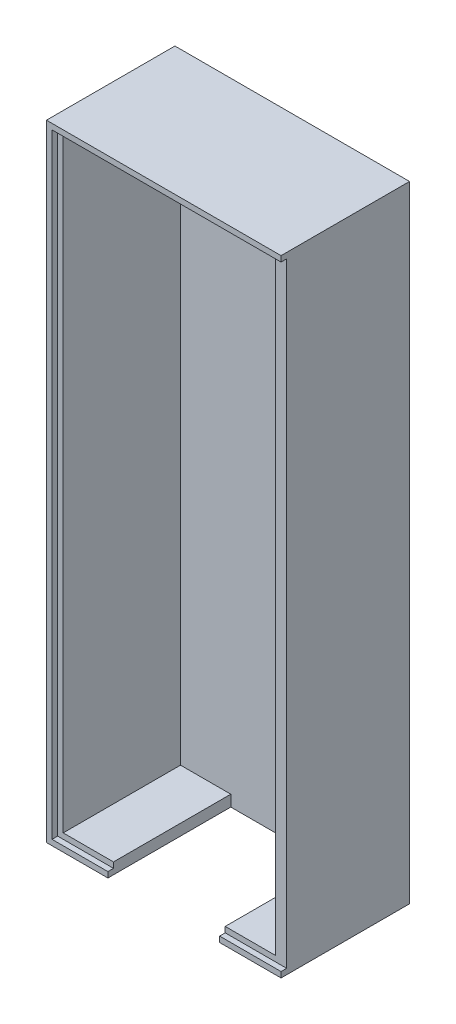
ISO-10303-21;
HEADER;
FILE_DESCRIPTION(('STEP AP214'),'2;1');
FILE_NAME('part.step','',(''),(''),'','','');
FILE_SCHEMA(('AUTOMOTIVE_DESIGN { 1 0 10303 214 1 1 1 1 }'));
ENDSEC;
DATA;
#1=APPLICATION_CONTEXT('core data for automotive mechanical design processes');
#2=APPLICATION_PROTOCOL_DEFINITION('international standard','automotive_design',2000,#1);
#3=PRODUCT_CONTEXT('',#1,'mechanical');
#4=PRODUCT('Part','Part','',(#3));
#5=PRODUCT_RELATED_PRODUCT_CATEGORY('part','',(#4));
#6=PRODUCT_DEFINITION_FORMATION('','',#4);
#7=PRODUCT_DEFINITION_CONTEXT('part definition',#1,'design');
#8=PRODUCT_DEFINITION('design','',#6,#7);
#9=PRODUCT_DEFINITION_SHAPE('','',#8);
#10=(LENGTH_UNIT() NAMED_UNIT(*) SI_UNIT(.MILLI.,.METRE.));
#11=(NAMED_UNIT(*) PLANE_ANGLE_UNIT() SI_UNIT($,.RADIAN.));
#12=(NAMED_UNIT(*) SI_UNIT($,.STERADIAN.) SOLID_ANGLE_UNIT());
#13=UNCERTAINTY_MEASURE_WITH_UNIT(LENGTH_MEASURE(1.E-05),#10,'distance_accuracy_value','');
#14=(GEOMETRIC_REPRESENTATION_CONTEXT(3) GLOBAL_UNCERTAINTY_ASSIGNED_CONTEXT((#13)) GLOBAL_UNIT_ASSIGNED_CONTEXT((#10,
#11,#12)) REPRESENTATION_CONTEXT('',''));
#15=CARTESIAN_POINT('',(0.,0.,0.));
#16=DIRECTION('',(0.,0.,1.));
#17=DIRECTION('',(1.,0.,0.));
#18=AXIS2_PLACEMENT_3D('',#15,#16,#17);
#19=CARTESIAN_POINT('',(0.,0.,22.));
#20=DIRECTION('',(0.,0.,-1.));
#21=DIRECTION('',(-1.,0.,0.));
#22=AXIS2_PLACEMENT_3D('',#19,#20,#21);
#23=PLANE('',#22);
#24=DIRECTION('',(1.,0.,0.));
#25=VECTOR('',#24,1.);
#26=CARTESIAN_POINT('',(0.,0.,22.));
#27=LINE('',#26,#25);
#28=CARTESIAN_POINT('',(30.,0.,22.));
#29=VERTEX_POINT('',#28);
#30=CARTESIAN_POINT('',(41.,0.,22.));
#31=VERTEX_POINT('',#30);
#32=EDGE_CURVE('E242',#29,#31,#27,.T.);
#33=ORIENTED_EDGE('',*,*,#32,.T.);
#34=DIRECTION('',(0.,-1.,0.));
#35=VECTOR('',#34,1.);
#36=CARTESIAN_POINT('',(41.,-1.,22.));
#37=LINE('',#36,#35);
#38=CARTESIAN_POINT('',(41.,110.,22.));
#39=VERTEX_POINT('',#38);
#40=EDGE_CURVE('E181',#39,#31,#37,.T.);
#41=ORIENTED_EDGE('',*,*,#40,.F.);
#42=DIRECTION('',(-1.,0.,0.));
#43=VECTOR('',#42,1.);
#44=CARTESIAN_POINT('',(0.,110.,22.));
#45=LINE('',#44,#43);
#46=CARTESIAN_POINT('',(0.,110.,22.));
#47=VERTEX_POINT('',#46);
#48=EDGE_CURVE('E41',#39,#47,#45,.T.);
#49=ORIENTED_EDGE('',*,*,#48,.T.);
#50=DIRECTION('',(0.,-1.,0.));
#51=VECTOR('',#50,1.);
#52=CARTESIAN_POINT('',(0.,0.,22.));
#53=LINE('',#52,#51);
#54=CARTESIAN_POINT('',(0.,0.,22.));
#55=VERTEX_POINT('',#54);
#56=EDGE_CURVE('E246',#47,#55,#53,.T.);
#57=ORIENTED_EDGE('',*,*,#56,.T.);
#58=CARTESIAN_POINT('',(10.,0.,22.));
#59=VERTEX_POINT('',#58);
#60=EDGE_CURVE('E245',#55,#59,#27,.T.);
#61=ORIENTED_EDGE('',*,*,#60,.T.);
#62=DIRECTION('',(0.,1.,0.));
#63=VECTOR('',#62,1.);
#64=CARTESIAN_POINT('',(10.,0.,22.));
#65=LINE('',#64,#63);
#66=CARTESIAN_POINT('',(10.,1.,22.));
#67=VERTEX_POINT('',#66);
#68=EDGE_CURVE('E297',#59,#67,#65,.T.);
#69=ORIENTED_EDGE('',*,*,#68,.T.);
#70=DIRECTION('',(1.,0.,0.));
#71=VECTOR('',#70,1.);
#72=CARTESIAN_POINT('',(0.,1.,22.));
#73=LINE('',#72,#71);
#74=CARTESIAN_POINT('',(1.,1.,22.));
#75=VERTEX_POINT('',#74);
#76=EDGE_CURVE('E332',#75,#67,#73,.T.);
#77=ORIENTED_EDGE('',*,*,#76,.F.);
#78=DIRECTION('',(0.,-1.,0.));
#79=VECTOR('',#78,1.);
#80=CARTESIAN_POINT('',(1.,0.,22.));
#81=LINE('',#80,#79);
#82=CARTESIAN_POINT('',(0.99999999999998,109.,22.));
#83=VERTEX_POINT('',#82);
#84=EDGE_CURVE('E329',#83,#75,#81,.T.);
#85=ORIENTED_EDGE('',*,*,#84,.F.);
#86=DIRECTION('',(-1.,0.,0.));
#87=VECTOR('',#86,1.);
#88=CARTESIAN_POINT('',(0.,109.,22.));
#89=LINE('',#88,#87);
#90=CARTESIAN_POINT('',(39.,109.,22.));
#91=VERTEX_POINT('',#90);
#92=EDGE_CURVE('E317',#91,#83,#89,.T.);
#93=ORIENTED_EDGE('',*,*,#92,.F.);
#94=DIRECTION('',(0.,1.,0.));
#95=VECTOR('',#94,1.);
#96=CARTESIAN_POINT('',(39.,0.,22.));
#97=LINE('',#96,#95);
#98=CARTESIAN_POINT('',(39.,1.,22.));
#99=VERTEX_POINT('',#98);
#100=EDGE_CURVE('E335',#99,#91,#97,.T.);
#101=ORIENTED_EDGE('',*,*,#100,.F.);
#102=CARTESIAN_POINT('',(30.,1.,22.));
#103=VERTEX_POINT('',#102);
#104=EDGE_CURVE('E331',#103,#99,#73,.T.);
#105=ORIENTED_EDGE('',*,*,#104,.F.);
#106=DIRECTION('',(0.,1.,0.));
#107=VECTOR('',#106,1.);
#108=CARTESIAN_POINT('',(30.,0.,22.));
#109=LINE('',#108,#107);
#110=EDGE_CURVE('E298',#29,#103,#109,.T.);
#111=ORIENTED_EDGE('',*,*,#110,.F.);
#112=EDGE_LOOP('',(#33,#41,#49,#57,#61,#69,#77,#85,#93,#101,#105,#111));
#113=FACE_BOUND('',#112,.T.);
#114=ADVANCED_FACE('F33',(#113),#23,.F.);
#115=CARTESIAN_POINT('',(-1.,0.,23.));
#116=DIRECTION('',(0.,0.,-1.));
#117=DIRECTION('',(0.,1.,0.));
#118=AXIS2_PLACEMENT_3D('',#115,#116,#117);
#119=PLANE('',#118);
#120=DIRECTION('',(-1.,0.,0.));
#121=VECTOR('',#120,1.);
#122=CARTESIAN_POINT('',(-1.,-1.,23.));
#123=LINE('',#122,#121);
#124=CARTESIAN_POINT('',(10.,-1.,23.));
#125=VERTEX_POINT('',#124);
#126=CARTESIAN_POINT('',(-1.,-1.,23.));
#127=VERTEX_POINT('',#126);
#128=EDGE_CURVE('E169',#125,#127,#123,.T.);
#129=ORIENTED_EDGE('',*,*,#128,.F.);
#130=DIRECTION('',(0.,1.,0.));
#131=VECTOR('',#130,1.);
#132=CARTESIAN_POINT('',(10.,-1.,23.));
#133=LINE('',#132,#131);
#134=CARTESIAN_POINT('',(10.,0.,23.));
#135=VERTEX_POINT('',#134);
#136=EDGE_CURVE('E221',#125,#135,#133,.T.);
#137=ORIENTED_EDGE('',*,*,#136,.T.);
#138=DIRECTION('',(-1.,0.,0.));
#139=VECTOR('',#138,1.);
#140=CARTESIAN_POINT('',(-1.,0.,23.));
#141=LINE('',#140,#139);
#142=CARTESIAN_POINT('',(0.,0.,23.));
#143=VERTEX_POINT('',#142);
#144=EDGE_CURVE('E224',#135,#143,#141,.T.);
#145=ORIENTED_EDGE('',*,*,#144,.T.);
#146=DIRECTION('',(0.,1.,0.));
#147=VECTOR('',#146,1.);
#148=CARTESIAN_POINT('',(0.,0.,23.));
#149=LINE('',#148,#147);
#150=CARTESIAN_POINT('',(0.,110.,23.));
#151=VERTEX_POINT('',#150);
#152=EDGE_CURVE('E238',#143,#151,#149,.T.);
#153=ORIENTED_EDGE('',*,*,#152,.T.);
#154=DIRECTION('',(1.,0.,0.));
#155=VECTOR('',#154,1.);
#156=CARTESIAN_POINT('',(-1.00000000000002,110.,23.));
#157=LINE('',#156,#155);
#158=CARTESIAN_POINT('',(41.,110.,23.));
#159=VERTEX_POINT('',#158);
#160=EDGE_CURVE('E180',#151,#159,#157,.T.);
#161=ORIENTED_EDGE('',*,*,#160,.T.);
#162=DIRECTION('',(0.,1.,0.));
#163=VECTOR('',#162,1.);
#164=CARTESIAN_POINT('',(41.,111.,23.));
#165=LINE('',#164,#163);
#166=CARTESIAN_POINT('',(41.,111.,23.));
#167=VERTEX_POINT('',#166);
#168=EDGE_CURVE('E188',#159,#167,#165,.T.);
#169=ORIENTED_EDGE('',*,*,#168,.T.);
#170=DIRECTION('',(1.,0.,0.));
#171=VECTOR('',#170,1.);
#172=CARTESIAN_POINT('',(-1.00000000000002,111.,23.));
#173=LINE('',#172,#171);
#174=CARTESIAN_POINT('',(-1.00000000000002,111.,23.));
#175=VERTEX_POINT('',#174);
#176=EDGE_CURVE('E204',#175,#167,#173,.T.);
#177=ORIENTED_EDGE('',*,*,#176,.F.);
#178=DIRECTION('',(0.,1.,0.));
#179=VECTOR('',#178,1.);
#180=CARTESIAN_POINT('',(-1.,0.,23.));
#181=LINE('',#180,#179);
#182=EDGE_CURVE('E278',#127,#175,#181,.T.);
#183=ORIENTED_EDGE('',*,*,#182,.F.);
#184=EDGE_LOOP('',(#129,#137,#145,#153,#161,#169,#177,#183));
#185=FACE_BOUND('',#184,.T.);
#186=ADVANCED_FACE('F271',(#185),#119,.F.);
#187=CARTESIAN_POINT('',(0.,0.,0.));
#188=DIRECTION('',(0.,1.,0.));
#189=DIRECTION('',(0.,0.,1.));
#190=AXIS2_PLACEMENT_3D('',#187,#188,#189);
#191=PLANE('',#190);
#192=DIRECTION('',(0.,0.,1.));
#193=VECTOR('',#192,1.);
#194=CARTESIAN_POINT('',(10.,0.,0.));
#195=LINE('',#194,#193);
#196=EDGE_CURVE('E11',#59,#135,#195,.T.);
#197=ORIENTED_EDGE('',*,*,#196,.F.);
#198=ORIENTED_EDGE('',*,*,#60,.F.);
#199=DIRECTION('',(0.,0.,1.));
#200=VECTOR('',#199,1.);
#201=CARTESIAN_POINT('',(0.,0.,0.));
#202=LINE('',#201,#200);
#203=EDGE_CURVE('E168',#55,#143,#202,.T.);
#204=ORIENTED_EDGE('',*,*,#203,.T.);
#205=ORIENTED_EDGE('',*,*,#144,.F.);
#206=EDGE_LOOP('',(#197,#198,#204,#205));
#207=FACE_BOUND('',#206,.T.);
#208=ADVANCED_FACE('F370',(#207),#191,.T.);
#209=CARTESIAN_POINT('',(0.,1.,22.));
#210=DIRECTION('',(0.,1.,0.));
#211=DIRECTION('',(0.,0.,1.));
#212=AXIS2_PLACEMENT_3D('',#209,#210,#211);
#213=PLANE('',#212);
#214=DIRECTION('',(0.,0.,1.));
#215=VECTOR('',#214,1.);
#216=CARTESIAN_POINT('',(10.,1.,1.));
#217=LINE('',#216,#215);
#218=CARTESIAN_POINT('',(10.,1.,1.));
#219=VERTEX_POINT('',#218);
#220=EDGE_CURVE('E284',#219,#67,#217,.T.);
#221=ORIENTED_EDGE('',*,*,#220,.F.);
#222=DIRECTION('',(1.,0.,0.));
#223=VECTOR('',#222,1.);
#224=CARTESIAN_POINT('',(0.,1.,1.));
#225=LINE('',#224,#223);
#226=CARTESIAN_POINT('',(1.,1.,1.));
#227=VERTEX_POINT('',#226);
#228=EDGE_CURVE('E318',#227,#219,#225,.T.);
#229=ORIENTED_EDGE('',*,*,#228,.F.);
#230=DIRECTION('',(0.,0.,-1.));
#231=VECTOR('',#230,1.);
#232=CARTESIAN_POINT('',(1.,1.,22.));
#233=LINE('',#232,#231);
#234=EDGE_CURVE('E258',#75,#227,#233,.T.);
#235=ORIENTED_EDGE('',*,*,#234,.F.);
#236=ORIENTED_EDGE('',*,*,#76,.T.);
#237=EDGE_LOOP('',(#221,#229,#235,#236));
#238=FACE_BOUND('',#237,.T.);
#239=ADVANCED_FACE('F350',(#238),#213,.T.);
#240=CARTESIAN_POINT('',(0.,0.,0.));
#241=DIRECTION('',(0.,0.,-1.));
#242=DIRECTION('',(-1.,0.,0.));
#243=AXIS2_PLACEMENT_3D('',#240,#241,#242);
#244=PLANE('',#243);
#245=DIRECTION('',(-1.,0.,0.));
#246=VECTOR('',#245,1.);
#247=CARTESIAN_POINT('',(-1.00000000000002,111.,0.));
#248=LINE('',#247,#246);
#249=CARTESIAN_POINT('',(41.,111.,0.));
#250=VERTEX_POINT('',#249);
#251=CARTESIAN_POINT('',(-1.00000000000002,111.,0.));
#252=VERTEX_POINT('',#251);
#253=EDGE_CURVE('E206',#250,#252,#248,.T.);
#254=ORIENTED_EDGE('',*,*,#253,.F.);
#255=DIRECTION('',(0.,1.,0.));
#256=VECTOR('',#255,1.);
#257=CARTESIAN_POINT('',(41.,-1.,0.));
#258=LINE('',#257,#256);
#259=CARTESIAN_POINT('',(41.,-1.,0.));
#260=VERTEX_POINT('',#259);
#261=EDGE_CURVE('E195',#260,#250,#258,.T.);
#262=ORIENTED_EDGE('',*,*,#261,.F.);
#263=DIRECTION('',(1.,0.,0.));
#264=VECTOR('',#263,1.);
#265=CARTESIAN_POINT('',(-1.,-1.,0.));
#266=LINE('',#265,#264);
#267=CARTESIAN_POINT('',(-1.,-1.,0.));
#268=VERTEX_POINT('',#267);
#269=EDGE_CURVE('E176',#268,#260,#266,.T.);
#270=ORIENTED_EDGE('',*,*,#269,.F.);
#271=DIRECTION('',(0.,-1.,0.));
#272=VECTOR('',#271,1.);
#273=CARTESIAN_POINT('',(-1.,0.,0.));
#274=LINE('',#273,#272);
#275=EDGE_CURVE('E276',#252,#268,#274,.T.);
#276=ORIENTED_EDGE('',*,*,#275,.F.);
#277=EDGE_LOOP('',(#254,#262,#270,#276));
#278=FACE_BOUND('',#277,.T.);
#279=ADVANCED_FACE('F35',(#278),#244,.T.);
#280=CARTESIAN_POINT('',(1.,0.,22.));
#281=DIRECTION('',(1.,0.,0.));
#282=DIRECTION('',(0.,1.,0.));
#283=AXIS2_PLACEMENT_3D('',#280,#281,#282);
#284=PLANE('',#283);
#285=DIRECTION('',(0.,-1.,0.));
#286=VECTOR('',#285,1.);
#287=CARTESIAN_POINT('',(1.,0.,1.));
#288=LINE('',#287,#286);
#289=CARTESIAN_POINT('',(0.99999999999998,109.,1.));
#290=VERTEX_POINT('',#289);
#291=EDGE_CURVE('E303',#290,#227,#288,.T.);
#292=ORIENTED_EDGE('',*,*,#291,.F.);
#293=DIRECTION('',(0.,0.,-1.));
#294=VECTOR('',#293,1.);
#295=CARTESIAN_POINT('',(0.99999999999998,109.,22.));
#296=LINE('',#295,#294);
#297=EDGE_CURVE('E313',#83,#290,#296,.T.);
#298=ORIENTED_EDGE('',*,*,#297,.F.);
#299=ORIENTED_EDGE('',*,*,#84,.T.);
#300=ORIENTED_EDGE('',*,*,#234,.T.);
#301=EDGE_LOOP('',(#292,#298,#299,#300));
#302=FACE_BOUND('',#301,.T.);
#303=ADVANCED_FACE('F346',(#302),#284,.T.);
#304=DIRECTION('',(0.,0.,-1.));
#305=VECTOR('',#304,1.);
#306=CARTESIAN_POINT('',(30.,1.,1.));
#307=LINE('',#306,#305);
#308=CARTESIAN_POINT('',(30.,1.,1.));
#309=VERTEX_POINT('',#308);
#310=EDGE_CURVE('E55',#103,#309,#307,.T.);
#311=ORIENTED_EDGE('',*,*,#310,.F.);
#312=ORIENTED_EDGE('',*,*,#104,.T.);
#313=DIRECTION('',(0.,0.,-1.));
#314=VECTOR('',#313,1.);
#315=CARTESIAN_POINT('',(39.,1.,22.));
#316=LINE('',#315,#314);
#317=CARTESIAN_POINT('',(39.,1.,1.));
#318=VERTEX_POINT('',#317);
#319=EDGE_CURVE('E312',#99,#318,#316,.T.);
#320=ORIENTED_EDGE('',*,*,#319,.T.);
#321=EDGE_CURVE('E309',#309,#318,#225,.T.);
#322=ORIENTED_EDGE('',*,*,#321,.F.);
#323=EDGE_LOOP('',(#311,#312,#320,#322));
#324=FACE_BOUND('',#323,.T.);
#325=ADVANCED_FACE('F360',(#324),#213,.T.);
#326=CARTESIAN_POINT('',(39.,0.,22.));
#327=DIRECTION('',(-1.,0.,0.));
#328=DIRECTION('',(0.,-1.,0.));
#329=AXIS2_PLACEMENT_3D('',#326,#327,#328);
#330=PLANE('',#329);
#331=DIRECTION('',(0.,1.,0.));
#332=VECTOR('',#331,1.);
#333=CARTESIAN_POINT('',(39.,0.,1.));
#334=LINE('',#333,#332);
#335=CARTESIAN_POINT('',(39.,109.,1.));
#336=VERTEX_POINT('',#335);
#337=EDGE_CURVE('E321',#318,#336,#334,.T.);
#338=ORIENTED_EDGE('',*,*,#337,.F.);
#339=ORIENTED_EDGE('',*,*,#319,.F.);
#340=ORIENTED_EDGE('',*,*,#100,.T.);
#341=DIRECTION('',(0.,0.,-1.));
#342=VECTOR('',#341,1.);
#343=CARTESIAN_POINT('',(39.,109.,22.));
#344=LINE('',#343,#342);
#345=EDGE_CURVE('E316',#91,#336,#344,.T.);
#346=ORIENTED_EDGE('',*,*,#345,.T.);
#347=EDGE_LOOP('',(#338,#339,#340,#346));
#348=FACE_BOUND('',#347,.T.);
#349=ADVANCED_FACE('F357',(#348),#330,.T.);
#350=CARTESIAN_POINT('',(0.,109.,22.));
#351=DIRECTION('',(0.,-1.,0.));
#352=DIRECTION('',(0.,0.,-1.));
#353=AXIS2_PLACEMENT_3D('',#350,#351,#352);
#354=PLANE('',#353);
#355=DIRECTION('',(-1.,0.,0.));
#356=VECTOR('',#355,1.);
#357=CARTESIAN_POINT('',(0.,109.,1.));
#358=LINE('',#357,#356);
#359=EDGE_CURVE('E325',#336,#290,#358,.T.);
#360=ORIENTED_EDGE('',*,*,#359,.F.);
#361=ORIENTED_EDGE('',*,*,#345,.F.);
#362=ORIENTED_EDGE('',*,*,#92,.T.);
#363=ORIENTED_EDGE('',*,*,#297,.T.);
#364=EDGE_LOOP('',(#360,#361,#362,#363));
#365=FACE_BOUND('',#364,.T.);
#366=ADVANCED_FACE('F341',(#365),#354,.T.);
#367=CARTESIAN_POINT('',(0.,0.,1.));
#368=DIRECTION('',(0.,0.,-1.));
#369=DIRECTION('',(-1.,0.,0.));
#370=AXIS2_PLACEMENT_3D('',#367,#368,#369);
#371=PLANE('',#370);
#372=ORIENTED_EDGE('',*,*,#291,.T.);
#373=ORIENTED_EDGE('',*,*,#228,.T.);
#374=DIRECTION('',(0.,1.,0.));
#375=VECTOR('',#374,1.);
#376=CARTESIAN_POINT('',(10.,0.,1.));
#377=LINE('',#376,#375);
#378=CARTESIAN_POINT('',(10.,-1.,1.));
#379=VERTEX_POINT('',#378);
#380=EDGE_CURVE('E301',#379,#219,#377,.T.);
#381=ORIENTED_EDGE('',*,*,#380,.F.);
#382=DIRECTION('',(-1.,0.,0.));
#383=VECTOR('',#382,1.);
#384=CARTESIAN_POINT('',(10.,-1.,1.));
#385=LINE('',#384,#383);
#386=CARTESIAN_POINT('',(30.,-1.,1.));
#387=VERTEX_POINT('',#386);
#388=EDGE_CURVE('E218',#387,#379,#385,.T.);
#389=ORIENTED_EDGE('',*,*,#388,.F.);
#390=DIRECTION('',(0.,1.,0.));
#391=VECTOR('',#390,1.);
#392=CARTESIAN_POINT('',(30.,0.,1.));
#393=LINE('',#392,#391);
#394=EDGE_CURVE('E304',#387,#309,#393,.T.);
#395=ORIENTED_EDGE('',*,*,#394,.T.);
#396=ORIENTED_EDGE('',*,*,#321,.T.);
#397=ORIENTED_EDGE('',*,*,#337,.T.);
#398=ORIENTED_EDGE('',*,*,#359,.T.);
#399=EDGE_LOOP('',(#372,#373,#381,#389,#395,#396,#397,#398));
#400=FACE_BOUND('',#399,.T.);
#401=ADVANCED_FACE('F352',(#400),#371,.F.);
#402=CARTESIAN_POINT('',(10.,0.,1.));
#403=DIRECTION('',(-1.,0.,0.));
#404=DIRECTION('',(0.,0.,1.));
#405=AXIS2_PLACEMENT_3D('',#402,#403,#404);
#406=PLANE('',#405);
#407=ORIENTED_EDGE('',*,*,#220,.T.);
#408=ORIENTED_EDGE('',*,*,#68,.F.);
#409=ORIENTED_EDGE('',*,*,#196,.T.);
#410=ORIENTED_EDGE('',*,*,#136,.F.);
#411=DIRECTION('',(0.,0.,1.));
#412=VECTOR('',#411,1.);
#413=CARTESIAN_POINT('',(10.,-1.,1.));
#414=LINE('',#413,#412);
#415=EDGE_CURVE('E213',#379,#125,#414,.T.);
#416=ORIENTED_EDGE('',*,*,#415,.F.);
#417=ORIENTED_EDGE('',*,*,#380,.T.);
#418=EDGE_LOOP('',(#407,#408,#409,#410,#416,#417));
#419=FACE_BOUND('',#418,.T.);
#420=ADVANCED_FACE('F379',(#419),#406,.F.);
#421=CARTESIAN_POINT('',(30.,0.,1.));
#422=DIRECTION('',(1.,0.,0.));
#423=DIRECTION('',(0.,0.,-1.));
#424=AXIS2_PLACEMENT_3D('',#421,#422,#423);
#425=PLANE('',#424);
#426=ORIENTED_EDGE('',*,*,#310,.T.);
#427=ORIENTED_EDGE('',*,*,#394,.F.);
#428=DIRECTION('',(0.,0.,-1.));
#429=VECTOR('',#428,1.);
#430=CARTESIAN_POINT('',(30.,-1.,1.));
#431=LINE('',#430,#429);
#432=CARTESIAN_POINT('',(30.,-1.,23.));
#433=VERTEX_POINT('',#432);
#434=EDGE_CURVE('E216',#433,#387,#431,.T.);
#435=ORIENTED_EDGE('',*,*,#434,.F.);
#436=DIRECTION('',(0.,1.,0.));
#437=VECTOR('',#436,1.);
#438=CARTESIAN_POINT('',(30.,-1.,23.));
#439=LINE('',#438,#437);
#440=CARTESIAN_POINT('',(30.,0.,23.));
#441=VERTEX_POINT('',#440);
#442=EDGE_CURVE('E165',#433,#441,#439,.T.);
#443=ORIENTED_EDGE('',*,*,#442,.T.);
#444=DIRECTION('',(0.,0.,-1.));
#445=VECTOR('',#444,1.);
#446=CARTESIAN_POINT('',(30.,0.,1.));
#447=LINE('',#446,#445);
#448=EDGE_CURVE('E209',#441,#29,#447,.T.);
#449=ORIENTED_EDGE('',*,*,#448,.T.);
#450=ORIENTED_EDGE('',*,*,#110,.T.);
#451=EDGE_LOOP('',(#426,#427,#435,#443,#449,#450));
#452=FACE_BOUND('',#451,.T.);
#453=ADVANCED_FACE('F397',(#452),#425,.F.);
#454=CARTESIAN_POINT('',(0.,0.,0.));
#455=DIRECTION('',(1.,0.,0.));
#456=DIRECTION('',(0.,1.,0.));
#457=AXIS2_PLACEMENT_3D('',#454,#455,#456);
#458=PLANE('',#457);
#459=ORIENTED_EDGE('',*,*,#56,.F.);
#460=DIRECTION('',(0.,0.,-1.));
#461=VECTOR('',#460,1.);
#462=CARTESIAN_POINT('',(0.,110.,0.));
#463=LINE('',#462,#461);
#464=EDGE_CURVE('E241',#151,#47,#463,.T.);
#465=ORIENTED_EDGE('',*,*,#464,.F.);
#466=ORIENTED_EDGE('',*,*,#152,.F.);
#467=ORIENTED_EDGE('',*,*,#203,.F.);
#468=EDGE_LOOP('',(#459,#465,#466,#467));
#469=FACE_BOUND('',#468,.T.);
#470=ADVANCED_FACE('F275',(#469),#458,.T.);
#471=CARTESIAN_POINT('',(41.,0.,23.));
#472=VERTEX_POINT('',#471);
#473=EDGE_CURVE('E229',#472,#441,#141,.T.);
#474=ORIENTED_EDGE('',*,*,#473,.T.);
#475=ORIENTED_EDGE('',*,*,#442,.F.);
#476=CARTESIAN_POINT('',(41.,-1.,23.));
#477=VERTEX_POINT('',#476);
#478=EDGE_CURVE('E158',#477,#433,#123,.T.);
#479=ORIENTED_EDGE('',*,*,#478,.F.);
#480=DIRECTION('',(0.,1.,0.));
#481=VECTOR('',#480,1.);
#482=CARTESIAN_POINT('',(41.,0.,23.));
#483=LINE('',#482,#481);
#484=EDGE_CURVE('E163',#477,#472,#483,.T.);
#485=ORIENTED_EDGE('',*,*,#484,.T.);
#486=EDGE_LOOP('',(#474,#475,#479,#485));
#487=FACE_BOUND('',#486,.T.);
#488=ADVANCED_FACE('F161',(#487),#119,.F.);
#489=CARTESIAN_POINT('',(-1.,0.,0.));
#490=DIRECTION('',(1.,0.,0.));
#491=DIRECTION('',(0.,1.,0.));
#492=AXIS2_PLACEMENT_3D('',#489,#490,#491);
#493=PLANE('',#492);
#494=ORIENTED_EDGE('',*,*,#275,.T.);
#495=DIRECTION('',(0.,0.,-1.));
#496=VECTOR('',#495,1.);
#497=CARTESIAN_POINT('',(-1.,-1.,0.));
#498=LINE('',#497,#496);
#499=EDGE_CURVE('E227',#127,#268,#498,.T.);
#500=ORIENTED_EDGE('',*,*,#499,.F.);
#501=ORIENTED_EDGE('',*,*,#182,.T.);
#502=DIRECTION('',(0.,0.,1.));
#503=VECTOR('',#502,1.);
#504=CARTESIAN_POINT('',(-1.00000000000002,111.,23.));
#505=LINE('',#504,#503);
#506=EDGE_CURVE('E201',#252,#175,#505,.T.);
#507=ORIENTED_EDGE('',*,*,#506,.F.);
#508=EDGE_LOOP('',(#494,#500,#501,#507));
#509=FACE_BOUND('',#508,.T.);
#510=ADVANCED_FACE('F417',(#509),#493,.F.);
#511=CARTESIAN_POINT('',(0.,-1.,0.));
#512=DIRECTION('',(0.,1.,0.));
#513=DIRECTION('',(0.,0.,1.));
#514=AXIS2_PLACEMENT_3D('',#511,#512,#513);
#515=PLANE('',#514);
#516=DIRECTION('',(0.,0.,-1.));
#517=VECTOR('',#516,1.);
#518=CARTESIAN_POINT('',(41.,-1.,0.));
#519=LINE('',#518,#517);
#520=EDGE_CURVE('E172',#477,#260,#519,.T.);
#521=ORIENTED_EDGE('',*,*,#520,.F.);
#522=ORIENTED_EDGE('',*,*,#478,.T.);
#523=ORIENTED_EDGE('',*,*,#434,.T.);
#524=ORIENTED_EDGE('',*,*,#388,.T.);
#525=ORIENTED_EDGE('',*,*,#415,.T.);
#526=ORIENTED_EDGE('',*,*,#128,.T.);
#527=ORIENTED_EDGE('',*,*,#499,.T.);
#528=ORIENTED_EDGE('',*,*,#269,.T.);
#529=EDGE_LOOP('',(#521,#522,#523,#524,#525,#526,#527,#528));
#530=FACE_BOUND('',#529,.T.);
#531=ADVANCED_FACE('F173',(#530),#515,.F.);
#532=ORIENTED_EDGE('',*,*,#448,.F.);
#533=ORIENTED_EDGE('',*,*,#473,.F.);
#534=DIRECTION('',(0.,0.,-1.));
#535=VECTOR('',#534,1.);
#536=CARTESIAN_POINT('',(41.,0.,23.));
#537=LINE('',#536,#535);
#538=EDGE_CURVE('E186',#472,#31,#537,.T.);
#539=ORIENTED_EDGE('',*,*,#538,.T.);
#540=ORIENTED_EDGE('',*,*,#32,.F.);
#541=EDGE_LOOP('',(#532,#533,#539,#540));
#542=FACE_BOUND('',#541,.T.);
#543=ADVANCED_FACE('F429',(#542),#191,.T.);
#544=CARTESIAN_POINT('',(0.,111.,0.));
#545=DIRECTION('',(0.,-1.,0.));
#546=DIRECTION('',(0.,0.,-1.));
#547=AXIS2_PLACEMENT_3D('',#544,#545,#546);
#548=PLANE('',#547);
#549=ORIENTED_EDGE('',*,*,#506,.T.);
#550=ORIENTED_EDGE('',*,*,#176,.T.);
#551=DIRECTION('',(0.,0.,1.));
#552=VECTOR('',#551,1.);
#553=CARTESIAN_POINT('',(41.,111.,0.));
#554=LINE('',#553,#552);
#555=EDGE_CURVE('E197',#250,#167,#554,.T.);
#556=ORIENTED_EDGE('',*,*,#555,.F.);
#557=ORIENTED_EDGE('',*,*,#253,.T.);
#558=EDGE_LOOP('',(#549,#550,#556,#557));
#559=FACE_BOUND('',#558,.T.);
#560=ADVANCED_FACE('F436',(#559),#548,.F.);
#561=CARTESIAN_POINT('',(0.,110.,0.));
#562=DIRECTION('',(0.,-1.,0.));
#563=DIRECTION('',(0.,0.,-1.));
#564=AXIS2_PLACEMENT_3D('',#561,#562,#563);
#565=PLANE('',#564);
#566=ORIENTED_EDGE('',*,*,#160,.F.);
#567=ORIENTED_EDGE('',*,*,#464,.T.);
#568=ORIENTED_EDGE('',*,*,#48,.F.);
#569=DIRECTION('',(0.,0.,-1.));
#570=VECTOR('',#569,1.);
#571=CARTESIAN_POINT('',(41.,110.,23.));
#572=LINE('',#571,#570);
#573=EDGE_CURVE('E193',#159,#39,#572,.T.);
#574=ORIENTED_EDGE('',*,*,#573,.F.);
#575=EDGE_LOOP('',(#566,#567,#568,#574));
#576=FACE_BOUND('',#575,.T.);
#577=ADVANCED_FACE('F266',(#576),#565,.T.);
#578=CARTESIAN_POINT('',(41.,0.,0.));
#579=DIRECTION('',(1.,0.,0.));
#580=DIRECTION('',(0.,1.,0.));
#581=AXIS2_PLACEMENT_3D('',#578,#579,#580);
#582=PLANE('',#581);
#583=ORIENTED_EDGE('',*,*,#261,.T.);
#584=ORIENTED_EDGE('',*,*,#555,.T.);
#585=ORIENTED_EDGE('',*,*,#168,.F.);
#586=ORIENTED_EDGE('',*,*,#573,.T.);
#587=ORIENTED_EDGE('',*,*,#40,.T.);
#588=ORIENTED_EDGE('',*,*,#538,.F.);
#589=ORIENTED_EDGE('',*,*,#484,.F.);
#590=ORIENTED_EDGE('',*,*,#520,.T.);
#591=EDGE_LOOP('',(#583,#584,#585,#586,#587,#588,#589,#590));
#592=FACE_BOUND('',#591,.T.);
#593=ADVANCED_FACE('F183',(#592),#582,.T.);
#594=CLOSED_SHELL('',(#114,#186,#208,#239,#279,#303,#325,#349,#366,#401,#420,#453,#470,#488,
#510,#531,#543,#560,#577,#593));
#595=MANIFOLD_SOLID_BREP('B2',#594);
#596=ADVANCED_BREP_SHAPE_REPRESENTATION('',(#18,#595),#14);
#597=SHAPE_DEFINITION_REPRESENTATION(#9,#596);
ENDSEC;
END-ISO-10303-21;
